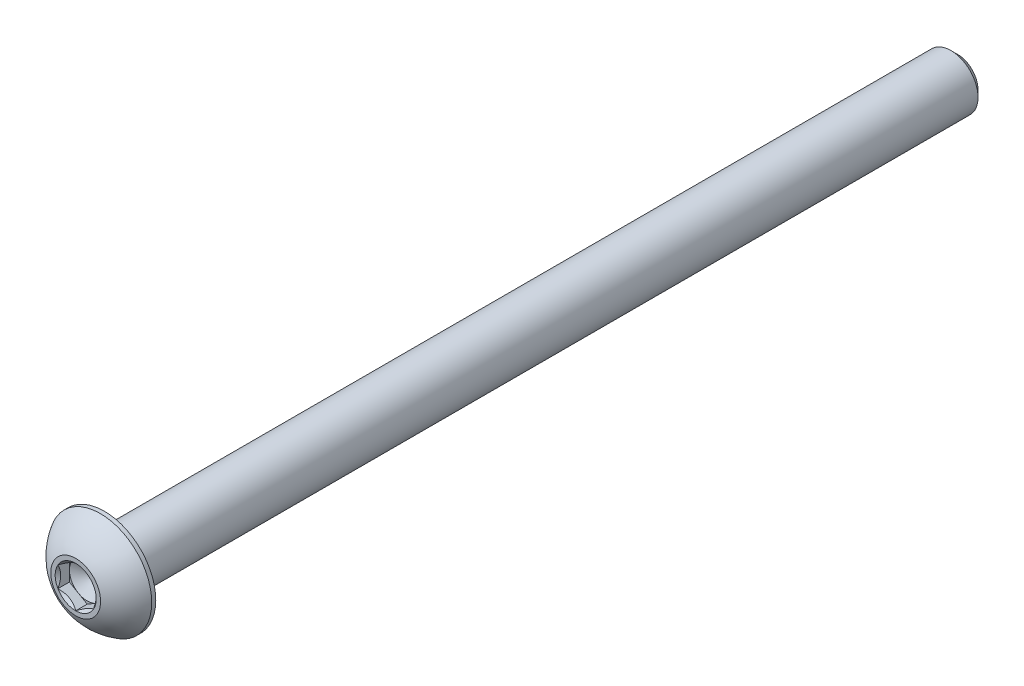
ISO-10303-21;
HEADER;
FILE_DESCRIPTION(('STEP AP214'),'2;1');
FILE_NAME('part.step','',(''),(''),'','','');
FILE_SCHEMA(('AUTOMOTIVE_DESIGN { 1 0 10303 214 1 1 1 1 }'));
ENDSEC;
DATA;
#1=APPLICATION_CONTEXT('core data for automotive mechanical design processes');
#2=APPLICATION_PROTOCOL_DEFINITION('international standard','automotive_design',2000,#1);
#3=PRODUCT_CONTEXT('',#1,'mechanical');
#4=PRODUCT('Part','Part','',(#3));
#5=PRODUCT_RELATED_PRODUCT_CATEGORY('part','',(#4));
#6=PRODUCT_DEFINITION_FORMATION('','',#4);
#7=PRODUCT_DEFINITION_CONTEXT('part definition',#1,'design');
#8=PRODUCT_DEFINITION('design','',#6,#7);
#9=PRODUCT_DEFINITION_SHAPE('','',#8);
#10=(LENGTH_UNIT() NAMED_UNIT(*) SI_UNIT(.MILLI.,.METRE.));
#11=(NAMED_UNIT(*) PLANE_ANGLE_UNIT() SI_UNIT($,.RADIAN.));
#12=(NAMED_UNIT(*) SI_UNIT($,.STERADIAN.) SOLID_ANGLE_UNIT());
#13=UNCERTAINTY_MEASURE_WITH_UNIT(LENGTH_MEASURE(1.E-05),#10,'distance_accuracy_value','');
#14=(GEOMETRIC_REPRESENTATION_CONTEXT(3) GLOBAL_UNCERTAINTY_ASSIGNED_CONTEXT((#13)) GLOBAL_UNIT_ASSIGNED_CONTEXT((#10,
#11,#12)) REPRESENTATION_CONTEXT('',''));
#15=CARTESIAN_POINT('',(0.,0.,0.));
#16=DIRECTION('',(0.,0.,1.));
#17=DIRECTION('',(1.,0.,0.));
#18=AXIS2_PLACEMENT_3D('',#15,#16,#17);
#19=CARTESIAN_POINT('',(0.,1.5875,39.3827));
#20=DIRECTION('',(0.,0.,-1.));
#21=DIRECTION('',(-1.,0.,0.));
#22=AXIS2_PLACEMENT_3D('',#19,#20,#21);
#23=PLANE('',#22);
#24=CARTESIAN_POINT('',(0.,0.,39.3827));
#25=DIRECTION('',(0.,0.,1.));
#26=DIRECTION('',(1.,0.,0.));
#27=AXIS2_PLACEMENT_3D('',#24,#25,#26);
#28=CIRCLE('',#27,2.2225);
#29=CARTESIAN_POINT('',(2.2225,0.,39.3827));
#30=VERTEX_POINT('',#29);
#31=EDGE_CURVE('E187',#30,#30,#28,.T.);
#32=ORIENTED_EDGE('',*,*,#31,.T.);
#33=EDGE_LOOP('',(#32));
#34=FACE_BOUND('',#33,.T.);
#35=CARTESIAN_POINT('',(0.,0.,39.3827));
#36=DIRECTION('',(0.,0.,1.));
#37=DIRECTION('',(1.,0.,0.));
#38=AXIS2_PLACEMENT_3D('',#35,#36,#37);
#39=CIRCLE('',#38,1.83308710467706);
#40=CARTESIAN_POINT('',(0.,1.83308710467706,39.3827));
#41=VERTEX_POINT('',#40);
#42=CARTESIAN_POINT('',(-1.5875,0.91654355233853,39.3827));
#43=VERTEX_POINT('',#42);
#44=EDGE_CURVE('E129',#41,#43,#39,.T.);
#45=ORIENTED_EDGE('',*,*,#44,.F.);
#46=CARTESIAN_POINT('',(0.,0.,39.3827));
#47=DIRECTION('',(0.,0.,1.));
#48=DIRECTION('',(1.,0.,0.));
#49=AXIS2_PLACEMENT_3D('',#46,#47,#48);
#50=CIRCLE('',#49,1.83308710467706);
#51=CARTESIAN_POINT('',(1.5875,0.916543552338531,39.3827));
#52=VERTEX_POINT('',#51);
#53=EDGE_CURVE('E113',#52,#41,#50,.T.);
#54=ORIENTED_EDGE('',*,*,#53,.F.);
#55=CARTESIAN_POINT('',(0.,0.,39.3827));
#56=DIRECTION('',(0.,0.,1.));
#57=DIRECTION('',(1.,0.,0.));
#58=AXIS2_PLACEMENT_3D('',#55,#56,#57);
#59=CIRCLE('',#58,1.83308710467706);
#60=CARTESIAN_POINT('',(1.5875,-0.916543552338529,39.3827));
#61=VERTEX_POINT('',#60);
#62=EDGE_CURVE('E125',#61,#52,#59,.T.);
#63=ORIENTED_EDGE('',*,*,#62,.F.);
#64=CARTESIAN_POINT('',(0.,0.,39.3827));
#65=DIRECTION('',(0.,0.,1.));
#66=DIRECTION('',(1.,0.,0.));
#67=AXIS2_PLACEMENT_3D('',#64,#65,#66);
#68=CIRCLE('',#67,1.83308710467706);
#69=CARTESIAN_POINT('',(0.,-1.83308710467706,39.3827));
#70=VERTEX_POINT('',#69);
#71=EDGE_CURVE('E149',#70,#61,#68,.T.);
#72=ORIENTED_EDGE('',*,*,#71,.F.);
#73=CARTESIAN_POINT('',(0.,0.,39.3827));
#74=DIRECTION('',(0.,0.,1.));
#75=DIRECTION('',(1.,0.,0.));
#76=AXIS2_PLACEMENT_3D('',#73,#74,#75);
#77=CIRCLE('',#76,1.83308710467706);
#78=CARTESIAN_POINT('',(-1.5875,-0.916543552338533,39.3827));
#79=VERTEX_POINT('',#78);
#80=EDGE_CURVE('E463',#79,#70,#77,.T.);
#81=ORIENTED_EDGE('',*,*,#80,.F.);
#82=CARTESIAN_POINT('',(0.,0.,39.3827));
#83=DIRECTION('',(0.,0.,1.));
#84=DIRECTION('',(1.,0.,0.));
#85=AXIS2_PLACEMENT_3D('',#82,#83,#84);
#86=CIRCLE('',#85,1.83308710467706);
#87=EDGE_CURVE('E474',#43,#79,#86,.T.);
#88=ORIENTED_EDGE('',*,*,#87,.F.);
#89=EDGE_LOOP('',(#45,#54,#63,#72,#81,#88));
#90=FACE_BOUND('',#89,.T.);
#91=ADVANCED_FACE('F39',(#34,#90),#23,.F.);
#92=CARTESIAN_POINT('',(0.,0.,-39.3827));
#93=DIRECTION('',(0.,0.,1.));
#94=DIRECTION('',(1.,0.,0.));
#95=AXIS2_PLACEMENT_3D('',#92,#93,#94);
#96=CONICAL_SURFACE('',#95,1.8176875,0.785398163397447);
#97=CARTESIAN_POINT('',(0.,0.,-38.7873875));
#98=DIRECTION('',(0.,0.,1.));
#99=DIRECTION('',(1.,0.,0.));
#100=AXIS2_PLACEMENT_3D('',#97,#98,#99);
#101=CIRCLE('',#100,2.413);
#102=CARTESIAN_POINT('',(2.413,0.,-38.7873875));
#103=VERTEX_POINT('',#102);
#104=EDGE_CURVE('E11',#103,#103,#101,.T.);
#105=ORIENTED_EDGE('',*,*,#104,.F.);
#106=EDGE_LOOP('',(#105));
#107=FACE_BOUND('',#106,.T.);
#108=CARTESIAN_POINT('',(0.,0.,-39.3827));
#109=DIRECTION('',(0.,0.,1.));
#110=DIRECTION('',(1.,0.,0.));
#111=AXIS2_PLACEMENT_3D('',#108,#109,#110);
#112=CIRCLE('',#111,1.8176875);
#113=CARTESIAN_POINT('',(1.8176875,0.,-39.3827));
#114=VERTEX_POINT('',#113);
#115=EDGE_CURVE('E178',#114,#114,#112,.T.);
#116=ORIENTED_EDGE('',*,*,#115,.T.);
#117=EDGE_LOOP('',(#116));
#118=FACE_BOUND('',#117,.T.);
#119=ADVANCED_FACE('F41',(#107,#118),#96,.T.);
#120=CARTESIAN_POINT('',(0.,0.,39.3827));
#121=DIRECTION('',(0.,0.,1.));
#122=DIRECTION('',(1.,0.,0.));
#123=AXIS2_PLACEMENT_3D('',#120,#121,#122);
#124=CYLINDRICAL_SURFACE('',#123,2.413);
#125=CARTESIAN_POINT('',(0.,0.,36.8173));
#126=DIRECTION('',(0.,0.,1.));
#127=DIRECTION('',(1.,0.,0.));
#128=AXIS2_PLACEMENT_3D('',#125,#126,#127);
#129=CIRCLE('',#128,2.413);
#130=CARTESIAN_POINT('',(2.413,0.,36.8173));
#131=VERTEX_POINT('',#130);
#132=EDGE_CURVE('E48',#131,#131,#129,.T.);
#133=ORIENTED_EDGE('',*,*,#132,.F.);
#134=EDGE_LOOP('',(#133));
#135=FACE_BOUND('',#134,.T.);
#136=ORIENTED_EDGE('',*,*,#104,.T.);
#137=EDGE_LOOP('',(#136));
#138=FACE_BOUND('',#137,.T.);
#139=ADVANCED_FACE('F205',(#135,#138),#124,.T.);
#140=CARTESIAN_POINT('',(0.,4.5847,36.8173));
#141=DIRECTION('',(0.,0.,1.));
#142=DIRECTION('',(1.,0.,0.));
#143=AXIS2_PLACEMENT_3D('',#140,#141,#142);
#144=PLANE('',#143);
#145=CARTESIAN_POINT('',(0.,0.,36.8173));
#146=DIRECTION('',(0.,0.,1.));
#147=DIRECTION('',(1.,0.,0.));
#148=AXIS2_PLACEMENT_3D('',#145,#146,#147);
#149=CIRCLE('',#148,4.5847);
#150=CARTESIAN_POINT('',(4.5847,0.,36.8173));
#151=VERTEX_POINT('',#150);
#152=EDGE_CURVE('E196',#151,#151,#149,.T.);
#153=ORIENTED_EDGE('',*,*,#152,.F.);
#154=EDGE_LOOP('',(#153));
#155=FACE_BOUND('',#154,.T.);
#156=ORIENTED_EDGE('',*,*,#132,.T.);
#157=EDGE_LOOP('',(#156));
#158=FACE_BOUND('',#157,.T.);
#159=ADVANCED_FACE('F203',(#155,#158),#144,.F.);
#160=CARTESIAN_POINT('',(0.,0.,39.3827));
#161=DIRECTION('',(0.,0.,1.));
#162=DIRECTION('',(1.,0.,0.));
#163=AXIS2_PLACEMENT_3D('',#160,#161,#162);
#164=CYLINDRICAL_SURFACE('',#163,4.5847);
#165=CARTESIAN_POINT('',(0.,0.,37.1801571428571));
#166=DIRECTION('',(0.,0.,1.));
#167=DIRECTION('',(1.,0.,0.));
#168=AXIS2_PLACEMENT_3D('',#165,#166,#167);
#169=CIRCLE('',#168,4.5847);
#170=CARTESIAN_POINT('',(4.5847,0.,37.1801571428571));
#171=VERTEX_POINT('',#170);
#172=EDGE_CURVE('E192',#171,#171,#169,.T.);
#173=ORIENTED_EDGE('',*,*,#172,.F.);
#174=EDGE_LOOP('',(#173));
#175=FACE_BOUND('',#174,.T.);
#176=ORIENTED_EDGE('',*,*,#152,.T.);
#177=EDGE_LOOP('',(#176));
#178=FACE_BOUND('',#177,.T.);
#179=ADVANCED_FACE('F224',(#175,#178),#164,.T.);
#180=CARTESIAN_POINT('',(0.,0.,34.6311096257943));
#181=DIRECTION('',(0.,0.,1.));
#182=DIRECTION('',(0.,1.,0.));
#183=AXIS2_PLACEMENT_3D('',#180,#181,#182);
#184=SPHERICAL_SURFACE('',#183,5.24567606074224);
#185=ORIENTED_EDGE('',*,*,#31,.F.);
#186=EDGE_LOOP('',(#185));
#187=FACE_BOUND('',#186,.T.);
#188=ORIENTED_EDGE('',*,*,#172,.T.);
#189=EDGE_LOOP('',(#188));
#190=FACE_BOUND('',#189,.T.);
#191=ADVANCED_FACE('F216',(#187,#190),#184,.T.);
#192=CARTESIAN_POINT('',(0.,1.8176875,-39.3827));
#193=DIRECTION('',(0.,0.,1.));
#194=DIRECTION('',(1.,0.,0.));
#195=AXIS2_PLACEMENT_3D('',#192,#193,#194);
#196=PLANE('',#195);
#197=ORIENTED_EDGE('',*,*,#115,.F.);
#198=EDGE_LOOP('',(#197));
#199=FACE_BOUND('',#198,.T.);
#200=ADVANCED_FACE('F214',(#199),#196,.F.);
#201=CARTESIAN_POINT('',(1.5875,0.916543552338531,39.3827));
#202=DIRECTION('',(-0.499999999999999,-0.866025403784439,0.));
#203=DIRECTION('',(0.866025403784439,-0.5,0.));
#204=AXIS2_PLACEMENT_3D('',#201,#202,#203);
#205=PLANE('',#204);
#206=CARTESIAN_POINT('',(1.5877,0.916428082284693,39.3828154809637));
#207=CARTESIAN_POINT('',(1.53312479190086,0.947937093371809,39.3513308083706));
#208=CARTESIAN_POINT('',(1.47763696320971,0.979973006203394,39.3216950460135));
#209=CARTESIAN_POINT('',(1.36449087915364,1.04529792829092,39.2674322600208));
#210=CARTESIAN_POINT('',(1.30682185887062,1.07859315267522,39.2428354351332));
#211=CARTESIAN_POINT('',(1.1905349781269,1.14573141457583,39.2007003642726));
#212=CARTESIAN_POINT('',(1.13194674474407,1.17955734689075,39.1830561927298));
#213=CARTESIAN_POINT('',(1.01348022674557,1.24795402294714,39.155871470085));
#214=CARTESIAN_POINT('',(0.953605562983895,1.28252267618758,39.1463106206951));
#215=CARTESIAN_POINT('',(0.850418771876558,1.34209759781022,39.137684413104));
#216=CARTESIAN_POINT('',(0.807240015952288,1.36702686416637,39.1364071928096));
#217=CARTESIAN_POINT('',(0.720953038535399,1.41684467380557,39.1385570558147));
#218=CARTESIAN_POINT('',(0.677844847078612,1.44173319974742,39.1419857885493));
#219=CARTESIAN_POINT('',(0.592046335002031,1.49126899379091,39.1533509944333));
#220=CARTESIAN_POINT('',(0.549356408925406,1.51591603410293,39.1612913718016));
#221=CARTESIAN_POINT('',(0.464693063478359,1.56479643938728,39.1812484144511));
#222=CARTESIAN_POINT('',(0.422719959755075,1.58902962212064,39.1932668292087));
#223=CARTESIAN_POINT('',(0.315211458113566,1.65109968448354,39.2289468972473));
#224=CARTESIAN_POINT('',(0.250342771708898,1.68855163804125,39.2552985723031));
#225=CARTESIAN_POINT('',(0.154961599380921,1.74361998356043,39.2997835368517));
#226=CARTESIAN_POINT('',(0.123530699536153,1.76176662204668,39.3154128578011));
#227=CARTESIAN_POINT('',(0.0612469855696333,1.79772614107138,39.3480984878611));
#228=CARTESIAN_POINT('',(0.0303939039605731,1.8155391760437,39.365154115657));
#229=CARTESIAN_POINT('',(-0.000200000000002724,1.8332025747309,39.3828154809637));
#230=B_SPLINE_CURVE_WITH_KNOTS('',3,(#206,#207,#208,#209,#210,#211,#212,#213,#214,#215,#216,
#217,#218,#219,#220,#221,#222,#223,#224,#225,#226,#227,#228,#229),.UNSPECIFIED.,.F.,.F.,(4,2,2,
2,2,2,2,2,2,2,2,4),(0.,0.211482650810816,0.424197870807277,0.633533884524818,0.842342653263349,
0.991755553727142,1.14122083674205,1.29081565918877,1.44047473906438,1.6781878086972,
1.79671410024894,1.91518409436631),.UNSPECIFIED.);
#231=EDGE_CURVE('E110',#52,#41,#230,.T.);
#232=ORIENTED_EDGE('',*,*,#231,.T.);
#233=DIRECTION('',(0.,0.,-1.));
#234=VECTOR('',#233,1.);
#235=CARTESIAN_POINT('',(0.,1.83308710467706,39.3827));
#236=LINE('',#235,#234);
#237=CARTESIAN_POINT('',(0.,1.83308710467706,38.35654));
#238=VERTEX_POINT('',#237);
#239=EDGE_CURVE('E175',#41,#238,#236,.T.);
#240=ORIENTED_EDGE('',*,*,#239,.T.);
#241=DIRECTION('',(-0.866025403784439,0.499999999999999,0.));
#242=VECTOR('',#241,1.);
#243=CARTESIAN_POINT('',(1.5875,0.916543552338531,38.35654));
#244=LINE('',#243,#242);
#245=CARTESIAN_POINT('',(0.793749999999999,1.3748153285078,38.35654));
#246=VERTEX_POINT('',#245);
#247=EDGE_CURVE('E505',#246,#238,#244,.T.);
#248=ORIENTED_EDGE('',*,*,#247,.F.);
#249=CARTESIAN_POINT('',(1.5875,0.916543552338531,38.35654));
#250=VERTEX_POINT('',#249);
#251=EDGE_CURVE('E55',#250,#246,#244,.T.);
#252=ORIENTED_EDGE('',*,*,#251,.F.);
#253=DIRECTION('',(0.,0.,-1.));
#254=VECTOR('',#253,1.);
#255=CARTESIAN_POINT('',(1.5875,0.916543552338531,39.3827));
#256=LINE('',#255,#254);
#257=EDGE_CURVE('E144',#52,#250,#256,.T.);
#258=ORIENTED_EDGE('',*,*,#257,.F.);
#259=EDGE_LOOP('',(#232,#240,#248,#252,#258));
#260=FACE_BOUND('',#259,.T.);
#261=ADVANCED_FACE('F151',(#260),#205,.T.);
#262=CARTESIAN_POINT('',(0.,1.83308710467706,39.3827));
#263=DIRECTION('',(0.5,-0.866025403784438,0.));
#264=DIRECTION('',(0.866025403784439,0.5,0.));
#265=AXIS2_PLACEMENT_3D('',#262,#263,#264);
#266=PLANE('',#265);
#267=CARTESIAN_POINT('',(0.000199999999999068,1.8332025747309,39.3828154809637));
#268=CARTESIAN_POINT('',(-0.0543752080991364,1.80169356364378,39.3513308083706));
#269=CARTESIAN_POINT('',(-0.10986303679029,1.7696576508122,39.3216950460135));
#270=CARTESIAN_POINT('',(-0.223009120846359,1.70433272872468,39.2674322600208));
#271=CARTESIAN_POINT('',(-0.280678141129382,1.67103750434037,39.2428354351332));
#272=CARTESIAN_POINT('',(-0.396965021873104,1.60389924243976,39.2007003642726));
#273=CARTESIAN_POINT('',(-0.455553255255932,1.57007331012484,39.1830561927298));
#274=CARTESIAN_POINT('',(-0.574019773254431,1.50167663406845,39.155871470085));
#275=CARTESIAN_POINT('',(-0.633894437016105,1.46710798082801,39.1463106206951));
#276=CARTESIAN_POINT('',(-0.737081228123442,1.40753305920537,39.137684413104));
#277=CARTESIAN_POINT('',(-0.780259984047712,1.38260379284922,39.1364071928096));
#278=CARTESIAN_POINT('',(-0.866546961464601,1.33278598321002,39.1385570558147));
#279=CARTESIAN_POINT('',(-0.909655152921388,1.30789745726817,39.1419857885493));
#280=CARTESIAN_POINT('',(-0.995453664997969,1.25836166322468,39.1533509944333));
#281=CARTESIAN_POINT('',(-1.03814359107459,1.23371462291266,39.1612913718016));
#282=CARTESIAN_POINT('',(-1.12280693652164,1.18483421762831,39.1812484144511));
#283=CARTESIAN_POINT('',(-1.16478004024492,1.16060103489495,39.1932668292087));
#284=CARTESIAN_POINT('',(-1.27228854188643,1.09853097253205,39.2289468972473));
#285=CARTESIAN_POINT('',(-1.3371572282911,1.06107901897434,39.2552985723031));
#286=CARTESIAN_POINT('',(-1.43253840061908,1.00601067345516,39.2997835368517));
#287=CARTESIAN_POINT('',(-1.46396930046384,0.987864034968913,39.3154128578011));
#288=CARTESIAN_POINT('',(-1.52625301443036,0.951904515944213,39.3480984878611));
#289=CARTESIAN_POINT('',(-1.55710609603942,0.934091480971892,39.365154115657));
#290=CARTESIAN_POINT('',(-1.5877,0.916428082284692,39.3828154809637));
#291=B_SPLINE_CURVE_WITH_KNOTS('',3,(#267,#268,#269,#270,#271,#272,#273,#274,#275,#276,#277,
#278,#279,#280,#281,#282,#283,#284,#285,#286,#287,#288,#289,#290),.UNSPECIFIED.,.F.,.F.,(4,2,2,
2,2,2,2,2,2,2,2,4),(0.,0.211482650810816,0.424197870807276,0.633533884524817,0.842342653263348,
0.991755553727141,1.14122083674204,1.29081565918877,1.44047473906438,1.6781878086972,
1.79671410024894,1.91518409436631),.UNSPECIFIED.);
#292=EDGE_CURVE('E490',#41,#43,#291,.T.);
#293=ORIENTED_EDGE('',*,*,#292,.T.);
#294=DIRECTION('',(0.,0.,-1.));
#295=VECTOR('',#294,1.);
#296=CARTESIAN_POINT('',(-1.5875,0.91654355233853,39.3827));
#297=LINE('',#296,#295);
#298=CARTESIAN_POINT('',(-1.5875,0.91654355233853,38.35654));
#299=VERTEX_POINT('',#298);
#300=EDGE_CURVE('E171',#43,#299,#297,.T.);
#301=ORIENTED_EDGE('',*,*,#300,.T.);
#302=DIRECTION('',(-0.866025403784438,-0.5,0.));
#303=VECTOR('',#302,1.);
#304=CARTESIAN_POINT('',(0.,1.83308710467706,38.35654));
#305=LINE('',#304,#303);
#306=CARTESIAN_POINT('',(-0.793750000000001,1.3748153285078,38.35654));
#307=VERTEX_POINT('',#306);
#308=EDGE_CURVE('E508',#307,#299,#305,.T.);
#309=ORIENTED_EDGE('',*,*,#308,.F.);
#310=EDGE_CURVE('E509',#238,#307,#305,.T.);
#311=ORIENTED_EDGE('',*,*,#310,.F.);
#312=ORIENTED_EDGE('',*,*,#239,.F.);
#313=EDGE_LOOP('',(#293,#301,#309,#311,#312));
#314=FACE_BOUND('',#313,.T.);
#315=ADVANCED_FACE('F222',(#314),#266,.T.);
#316=CARTESIAN_POINT('',(-1.5875,0.91654355233853,39.3827));
#317=DIRECTION('',(1.,0.,0.));
#318=DIRECTION('',(0.,1.,0.));
#319=AXIS2_PLACEMENT_3D('',#316,#317,#318);
#320=PLANE('',#319);
#321=CARTESIAN_POINT('',(-1.5875,-1.8064504268921,39.954486986584));
#322=CARTESIAN_POINT('',(-1.5875,-1.76236619947005,39.9213776518922));
#323=CARTESIAN_POINT('',(-1.5875,-1.7180340172246,39.8885993672874));
#324=CARTESIAN_POINT('',(-1.5875,-1.62877387436181,39.8238409272978));
#325=CARTESIAN_POINT('',(-1.5875,-1.58384576476286,39.7918609774832));
#326=CARTESIAN_POINT('',(-1.5875,-1.44736053267712,39.6968669615479));
#327=CARTESIAN_POINT('',(-1.5875,-1.3547728804759,39.6353088242448));
#328=CARTESIAN_POINT('',(-1.5875,-1.16075761948671,39.5146575197201));
#329=CARTESIAN_POINT('',(-1.5875,-1.05912459725148,39.4558908440981));
#330=CARTESIAN_POINT('',(-1.5875,-0.850810108093359,39.3485306781203));
#331=CARTESIAN_POINT('',(-1.5875,-0.744147188151387,39.2999029254242));
#332=CARTESIAN_POINT('',(-1.5875,-0.583837187923048,39.2404180795062));
#333=CARTESIAN_POINT('',(-1.5875,-0.532518160842362,39.2233101147626));
#334=CARTESIAN_POINT('',(-1.5875,-0.42865998551387,39.1932170530757));
#335=CARTESIAN_POINT('',(-1.5875,-0.376120751676573,39.1802322462879));
#336=CARTESIAN_POINT('',(-1.5875,-0.271003698108571,39.1592703974627));
#337=CARTESIAN_POINT('',(-1.5875,-0.218442994151925,39.1512088512206));
#338=CARTESIAN_POINT('',(-1.5875,-0.112783135871374,39.1402474681039));
#339=CARTESIAN_POINT('',(-1.5875,-0.0596840710482713,39.1373467869566));
#340=CARTESIAN_POINT('',(-1.5875,0.0447055832560292,39.1369138193186));
#341=CARTESIAN_POINT('',(-1.5875,0.0959954901561852,39.1392001279368));
#342=CARTESIAN_POINT('',(-1.5875,0.19812518570528,39.1486197058015));
#343=CARTESIAN_POINT('',(-1.5875,0.248964929488492,39.1557534527826));
#344=CARTESIAN_POINT('',(-1.5875,0.350686556652123,39.1746031096994));
#345=CARTESIAN_POINT('',(-1.5875,0.401553911407878,39.186396261495));
#346=CARTESIAN_POINT('',(-1.5875,0.50217981053946,39.2139444375564));
#347=CARTESIAN_POINT('',(-1.5875,0.551938454553038,39.2296991042323));
#348=CARTESIAN_POINT('',(-1.5875,0.70959794154669,39.2855173760564));
#349=CARTESIAN_POINT('',(-1.5875,0.815228306930164,39.3319791563384));
#350=CARTESIAN_POINT('',(-1.5875,1.02151735170486,39.4352514550853));
#351=CARTESIAN_POINT('',(-1.5875,1.12215634479546,39.4920993580816));
#352=CARTESIAN_POINT('',(-1.5875,1.31447644029508,39.6093491247074));
#353=CARTESIAN_POINT('',(-1.5875,1.40635401847359,39.6694326845134));
#354=CARTESIAN_POINT('',(-1.5875,1.54171769329396,39.7623019080447));
#355=CARTESIAN_POINT('',(-1.5875,1.58625419266992,39.7935831278697));
#356=CARTESIAN_POINT('',(-1.5875,1.67471932537719,39.8569692036077));
#357=CARTESIAN_POINT('',(-1.5875,1.71864812234279,39.8890738308869));
#358=CARTESIAN_POINT('',(-1.5875,1.76232404534813,39.9215197844761));
#359=B_SPLINE_CURVE_WITH_KNOTS('',3,(#321,#322,#323,#324,#325,#326,#327,#328,#329,#330,#331,
#332,#333,#334,#335,#336,#337,#338,#339,#340,#341,#342,#343,#344,#345,#346,#347,#348,#349,#350,
#351,#352,#353,#354,#355,#356,#357,#358),.UNSPECIFIED.,.F.,.F.,(4,2,2,2,2,2,2,2,2,2,2,2,2,2,2,2,
2,2,4),(0.,0.165394720611774,0.330831599805607,0.664230904656284,1.01613642769877,
1.36683276443451,1.5289815746679,1.69114179313303,1.85043410106595,2.00970034776347,
2.16348276168557,2.31728033368488,2.47374234648083,2.63019024115108,2.97536284656899,
3.32180328575216,3.6509785319665,3.81424551593161,3.97746764647571),.UNSPECIFIED.);
#360=EDGE_CURVE('E482',#43,#79,#359,.F.);
#361=ORIENTED_EDGE('',*,*,#360,.T.);
#362=DIRECTION('',(0.,0.,-1.));
#363=VECTOR('',#362,1.);
#364=CARTESIAN_POINT('',(-1.5875,-0.916543552338532,39.3827));
#365=LINE('',#364,#363);
#366=CARTESIAN_POINT('',(-1.5875,-0.916543552338532,38.35654));
#367=VERTEX_POINT('',#366);
#368=EDGE_CURVE('E167',#79,#367,#365,.T.);
#369=ORIENTED_EDGE('',*,*,#368,.T.);
#370=DIRECTION('',(0.,-1.,0.));
#371=VECTOR('',#370,1.);
#372=CARTESIAN_POINT('',(-1.5875,0.91654355233853,38.35654));
#373=LINE('',#372,#371);
#374=CARTESIAN_POINT('',(-1.5875,0.,38.35654));
#375=VERTEX_POINT('',#374);
#376=EDGE_CURVE('E513',#375,#367,#373,.T.);
#377=ORIENTED_EDGE('',*,*,#376,.F.);
#378=EDGE_CURVE('E514',#299,#375,#373,.T.);
#379=ORIENTED_EDGE('',*,*,#378,.F.);
#380=ORIENTED_EDGE('',*,*,#300,.F.);
#381=EDGE_LOOP('',(#361,#369,#377,#379,#380));
#382=FACE_BOUND('',#381,.T.);
#383=ADVANCED_FACE('F343',(#382),#320,.T.);
#384=CARTESIAN_POINT('',(-1.5875,-0.916543552338532,39.3827));
#385=DIRECTION('',(0.499999999999999,0.866025403784439,0.));
#386=DIRECTION('',(-0.866025403784439,0.5,0.));
#387=AXIS2_PLACEMENT_3D('',#384,#385,#386);
#388=PLANE('',#387);
#389=CARTESIAN_POINT('',(-1.5877,-0.916428082284694,39.3828154809637));
#390=CARTESIAN_POINT('',(-1.53312479190086,-0.94793709337181,39.3513308083706));
#391=CARTESIAN_POINT('',(-1.47763696320971,-0.979973006203395,39.3216950460135));
#392=CARTESIAN_POINT('',(-1.36449087915364,-1.04529792829092,39.2674322600208));
#393=CARTESIAN_POINT('',(-1.30682185887062,-1.07859315267522,39.2428354351332));
#394=CARTESIAN_POINT('',(-1.1905349781269,-1.14573141457583,39.2007003642726));
#395=CARTESIAN_POINT('',(-1.13194674474407,-1.17955734689075,39.1830561927298));
#396=CARTESIAN_POINT('',(-1.01348022674557,-1.24795402294715,39.155871470085));
#397=CARTESIAN_POINT('',(-0.953605562983895,-1.28252267618759,39.1463106206951));
#398=CARTESIAN_POINT('',(-0.850418771876557,-1.34209759781022,39.137684413104));
#399=CARTESIAN_POINT('',(-0.807240015952287,-1.36702686416637,39.1364071928096));
#400=CARTESIAN_POINT('',(-0.720953038535398,-1.41684467380557,39.1385570558147));
#401=CARTESIAN_POINT('',(-0.677844847078612,-1.44173319974742,39.1419857885493));
#402=CARTESIAN_POINT('',(-0.59204633500203,-1.49126899379091,39.1533509944333));
#403=CARTESIAN_POINT('',(-0.549356408925405,-1.51591603410293,39.1612913718016));
#404=CARTESIAN_POINT('',(-0.464693063478358,-1.56479643938728,39.1812484144511));
#405=CARTESIAN_POINT('',(-0.422719959755074,-1.58902962212064,39.1932668292087));
#406=CARTESIAN_POINT('',(-0.315211458113565,-1.65109968448354,39.2289468972473));
#407=CARTESIAN_POINT('',(-0.250342771708898,-1.68855163804125,39.2552985723031));
#408=CARTESIAN_POINT('',(-0.154961599380922,-1.74361998356043,39.2997835368517));
#409=CARTESIAN_POINT('',(-0.123530699536154,-1.76176662204668,39.3154128578011));
#410=CARTESIAN_POINT('',(-0.0612469855696344,-1.79772614107138,39.3480984878611));
#411=CARTESIAN_POINT('',(-0.0303939039605742,-1.8155391760437,39.365154115657));
#412=CARTESIAN_POINT('',(0.000200000000001885,-1.8332025747309,39.3828154809637));
#413=B_SPLINE_CURVE_WITH_KNOTS('',3,(#389,#390,#391,#392,#393,#394,#395,#396,#397,#398,#399,
#400,#401,#402,#403,#404,#405,#406,#407,#408,#409,#410,#411,#412),.UNSPECIFIED.,.F.,.F.,(4,2,2,
2,2,2,2,2,2,2,2,4),(0.,0.211482650810817,0.424197870807277,0.633533884524818,0.842342653263349,
0.991755553727142,1.14122083674205,1.29081565918877,1.44047473906438,1.6781878086972,
1.79671410024894,1.91518409436631),.UNSPECIFIED.);
#414=EDGE_CURVE('E466',#79,#70,#413,.T.);
#415=ORIENTED_EDGE('',*,*,#414,.T.);
#416=DIRECTION('',(0.,0.,-1.));
#417=VECTOR('',#416,1.);
#418=CARTESIAN_POINT('',(0.,-1.83308710467706,39.3827));
#419=LINE('',#418,#417);
#420=CARTESIAN_POINT('',(0.,-1.83308710467706,38.35654));
#421=VERTEX_POINT('',#420);
#422=EDGE_CURVE('E157',#70,#421,#419,.T.);
#423=ORIENTED_EDGE('',*,*,#422,.T.);
#424=DIRECTION('',(0.866025403784439,-0.499999999999999,0.));
#425=VECTOR('',#424,1.);
#426=CARTESIAN_POINT('',(-1.5875,-0.916543552338532,38.35654));
#427=LINE('',#426,#425);
#428=CARTESIAN_POINT('',(-0.793749999999999,-1.3748153285078,38.35654));
#429=VERTEX_POINT('',#428);
#430=EDGE_CURVE('E518',#429,#421,#427,.T.);
#431=ORIENTED_EDGE('',*,*,#430,.F.);
#432=EDGE_CURVE('E519',#367,#429,#427,.T.);
#433=ORIENTED_EDGE('',*,*,#432,.F.);
#434=ORIENTED_EDGE('',*,*,#368,.F.);
#435=EDGE_LOOP('',(#415,#423,#431,#433,#434));
#436=FACE_BOUND('',#435,.T.);
#437=ADVANCED_FACE('F353',(#436),#388,.T.);
#438=CARTESIAN_POINT('',(0.,-1.83308710467706,39.3827));
#439=DIRECTION('',(-0.5,0.866025403784438,0.));
#440=DIRECTION('',(-0.866025403784439,-0.5,0.));
#441=AXIS2_PLACEMENT_3D('',#438,#439,#440);
#442=PLANE('',#441);
#443=CARTESIAN_POINT('',(-0.00019999999999924,-1.8332025747309,39.3828154809637));
#444=CARTESIAN_POINT('',(0.0543752080991368,-1.80169356364378,39.3513308083706));
#445=CARTESIAN_POINT('',(0.10986303679029,-1.7696576508122,39.3216950460135));
#446=CARTESIAN_POINT('',(0.223009120846359,-1.70433272872468,39.2674322600208));
#447=CARTESIAN_POINT('',(0.280678141129382,-1.67103750434037,39.2428354351332));
#448=CARTESIAN_POINT('',(0.396965021873104,-1.60389924243976,39.2007003642726));
#449=CARTESIAN_POINT('',(0.455553255255933,-1.57007331012484,39.1830561927298));
#450=CARTESIAN_POINT('',(0.574019773254432,-1.50167663406845,39.155871470085));
#451=CARTESIAN_POINT('',(0.633894437016105,-1.46710798082801,39.1463106206951));
#452=CARTESIAN_POINT('',(0.737081228123442,-1.40753305920537,39.137684413104));
#453=CARTESIAN_POINT('',(0.780259984047712,-1.38260379284922,39.1364071928096));
#454=CARTESIAN_POINT('',(0.866546961464601,-1.33278598321002,39.1385570558147));
#455=CARTESIAN_POINT('',(0.909655152921387,-1.30789745726817,39.1419857885493));
#456=CARTESIAN_POINT('',(0.995453664997969,-1.25836166322469,39.1533509944333));
#457=CARTESIAN_POINT('',(1.03814359107459,-1.23371462291266,39.1612913718016));
#458=CARTESIAN_POINT('',(1.12280693652164,-1.18483421762831,39.1812484144511));
#459=CARTESIAN_POINT('',(1.16478004024492,-1.16060103489495,39.1932668292087));
#460=CARTESIAN_POINT('',(1.27228854188643,-1.09853097253205,39.2289468972473));
#461=CARTESIAN_POINT('',(1.3371572282911,-1.06107901897434,39.2552985723031));
#462=CARTESIAN_POINT('',(1.43253840061908,-1.00601067345516,39.2997835368517));
#463=CARTESIAN_POINT('',(1.46396930046384,-0.987864034968913,39.3154128578011));
#464=CARTESIAN_POINT('',(1.52625301443036,-0.951904515944213,39.3480984878611));
#465=CARTESIAN_POINT('',(1.55710609603942,-0.934091480971892,39.365154115657));
#466=CARTESIAN_POINT('',(1.5877,-0.916428082284692,39.3828154809637));
#467=B_SPLINE_CURVE_WITH_KNOTS('',3,(#443,#444,#445,#446,#447,#448,#449,#450,#451,#452,#453,
#454,#455,#456,#457,#458,#459,#460,#461,#462,#463,#464,#465,#466),.UNSPECIFIED.,.F.,.F.,(4,2,2,
2,2,2,2,2,2,2,2,4),(0.,0.211482650810816,0.424197870807277,0.633533884524816,0.842342653263347,
0.99175555372714,1.14122083674204,1.29081565918877,1.44047473906437,1.6781878086972,
1.79671410024894,1.91518409436631),.UNSPECIFIED.);
#468=EDGE_CURVE('E455',#70,#61,#467,.T.);
#469=ORIENTED_EDGE('',*,*,#468,.T.);
#470=DIRECTION('',(0.,0.,-1.));
#471=VECTOR('',#470,1.);
#472=CARTESIAN_POINT('',(1.5875,-0.916543552338531,39.3827));
#473=LINE('',#472,#471);
#474=CARTESIAN_POINT('',(1.5875,-0.916543552338531,38.35654));
#475=VERTEX_POINT('',#474);
#476=EDGE_CURVE('E147',#61,#475,#473,.T.);
#477=ORIENTED_EDGE('',*,*,#476,.T.);
#478=DIRECTION('',(0.866025403784438,0.5,0.));
#479=VECTOR('',#478,1.);
#480=CARTESIAN_POINT('',(0.,-1.83308710467706,38.35654));
#481=LINE('',#480,#479);
#482=CARTESIAN_POINT('',(0.79375,-1.3748153285078,38.35654));
#483=VERTEX_POINT('',#482);
#484=EDGE_CURVE('E522',#483,#475,#481,.T.);
#485=ORIENTED_EDGE('',*,*,#484,.F.);
#486=EDGE_CURVE('E523',#421,#483,#481,.T.);
#487=ORIENTED_EDGE('',*,*,#486,.F.);
#488=ORIENTED_EDGE('',*,*,#422,.F.);
#489=EDGE_LOOP('',(#469,#477,#485,#487,#488));
#490=FACE_BOUND('',#489,.T.);
#491=ADVANCED_FACE('F363',(#490),#442,.T.);
#492=CARTESIAN_POINT('',(1.5875,-0.916543552338531,39.3827));
#493=DIRECTION('',(-1.,0.,0.));
#494=DIRECTION('',(0.,-1.,0.));
#495=AXIS2_PLACEMENT_3D('',#492,#493,#494);
#496=PLANE('',#495);
#497=CARTESIAN_POINT('',(1.5875,-1.8064504268921,39.954486986584));
#498=CARTESIAN_POINT('',(1.5875,-1.76236619947005,39.9213776518922));
#499=CARTESIAN_POINT('',(1.5875,-1.71803401722459,39.8885993672874));
#500=CARTESIAN_POINT('',(1.5875,-1.62877387436181,39.8238409272978));
#501=CARTESIAN_POINT('',(1.5875,-1.58384576476286,39.7918609774832));
#502=CARTESIAN_POINT('',(1.5875,-1.44736053267712,39.6968669615479));
#503=CARTESIAN_POINT('',(1.5875,-1.3547728804759,39.6353088242448));
#504=CARTESIAN_POINT('',(1.5875,-1.16075761948671,39.5146575197201));
#505=CARTESIAN_POINT('',(1.5875,-1.05912459725148,39.4558908440981));
#506=CARTESIAN_POINT('',(1.5875,-0.850810108093356,39.3485306781203));
#507=CARTESIAN_POINT('',(1.5875,-0.744147188151385,39.2999029254242));
#508=CARTESIAN_POINT('',(1.5875,-0.583837187923047,39.2404180795062));
#509=CARTESIAN_POINT('',(1.5875,-0.53251816084236,39.2233101147626));
#510=CARTESIAN_POINT('',(1.5875,-0.428659985513868,39.1932170530757));
#511=CARTESIAN_POINT('',(1.5875,-0.376120751676572,39.1802322462879));
#512=CARTESIAN_POINT('',(1.5875,-0.27100369810857,39.1592703974627));
#513=CARTESIAN_POINT('',(1.5875,-0.218442994151923,39.1512088512206));
#514=CARTESIAN_POINT('',(1.5875,-0.112783135871373,39.1402474681039));
#515=CARTESIAN_POINT('',(1.5875,-0.0596840710482703,39.1373467869566));
#516=CARTESIAN_POINT('',(1.5875,0.0447055832560299,39.1369138193186));
#517=CARTESIAN_POINT('',(1.5875,0.0959954901561857,39.1392001279368));
#518=CARTESIAN_POINT('',(1.5875,0.19812518570528,39.1486197058015));
#519=CARTESIAN_POINT('',(1.5875,0.248964929488492,39.1557534527826));
#520=CARTESIAN_POINT('',(1.5875,0.350686556652123,39.1746031096994));
#521=CARTESIAN_POINT('',(1.5875,0.401553911407877,39.186396261495));
#522=CARTESIAN_POINT('',(1.5875,0.50217981053946,39.2139444375564));
#523=CARTESIAN_POINT('',(1.5875,0.551938454553039,39.2296991042323));
#524=CARTESIAN_POINT('',(1.5875,0.709597941546691,39.2855173760564));
#525=CARTESIAN_POINT('',(1.5875,0.815228306930165,39.3319791563384));
#526=CARTESIAN_POINT('',(1.5875,1.02151735170486,39.4352514550853));
#527=CARTESIAN_POINT('',(1.5875,1.12215634479546,39.4920993580816));
#528=CARTESIAN_POINT('',(1.5875,1.31447644029508,39.6093491247074));
#529=CARTESIAN_POINT('',(1.5875,1.40635401847359,39.6694326845134));
#530=CARTESIAN_POINT('',(1.5875,1.54171769329396,39.7623019080447));
#531=CARTESIAN_POINT('',(1.5875,1.58625419266992,39.7935831278697));
#532=CARTESIAN_POINT('',(1.5875,1.67471932537719,39.8569692036077));
#533=CARTESIAN_POINT('',(1.5875,1.71864812234279,39.8890738308869));
#534=CARTESIAN_POINT('',(1.5875,1.76232404534813,39.9215197844761));
#535=B_SPLINE_CURVE_WITH_KNOTS('',3,(#497,#498,#499,#500,#501,#502,#503,#504,#505,#506,#507,
#508,#509,#510,#511,#512,#513,#514,#515,#516,#517,#518,#519,#520,#521,#522,#523,#524,#525,#526,
#527,#528,#529,#530,#531,#532,#533,#534),.UNSPECIFIED.,.F.,.F.,(4,2,2,2,2,2,2,2,2,2,2,2,2,2,2,2,
2,2,4),(0.,0.165394720611774,0.330831599805608,0.664230904656285,1.01613642769877,
1.36683276443451,1.5289815746679,1.69114179313303,1.85043410106595,2.00970034776347,
2.16348276168557,2.31728033368488,2.47374234648083,2.63019024115108,2.97536284656899,
3.32180328575216,3.6509785319665,3.81424551593161,3.97746764647571),.UNSPECIFIED.);
#536=EDGE_CURVE('E136',#61,#52,#535,.T.);
#537=ORIENTED_EDGE('',*,*,#536,.T.);
#538=ORIENTED_EDGE('',*,*,#257,.T.);
#539=DIRECTION('',(0.,1.,0.));
#540=VECTOR('',#539,1.);
#541=CARTESIAN_POINT('',(1.5875,-0.916543552338531,38.35654));
#542=LINE('',#541,#540);
#543=CARTESIAN_POINT('',(1.5875,0.,38.35654));
#544=VERTEX_POINT('',#543);
#545=EDGE_CURVE('E160',#544,#250,#542,.T.);
#546=ORIENTED_EDGE('',*,*,#545,.F.);
#547=EDGE_CURVE('E153',#475,#544,#542,.T.);
#548=ORIENTED_EDGE('',*,*,#547,.F.);
#549=ORIENTED_EDGE('',*,*,#476,.F.);
#550=EDGE_LOOP('',(#537,#538,#546,#548,#549));
#551=FACE_BOUND('',#550,.T.);
#552=ADVANCED_FACE('F142',(#551),#496,.T.);
#553=CARTESIAN_POINT('',(0.,0.,38.35654));
#554=DIRECTION('',(0.,0.,1.));
#555=DIRECTION('',(1.,0.,0.));
#556=AXIS2_PLACEMENT_3D('',#553,#554,#555);
#557=PLANE('',#556);
#558=CARTESIAN_POINT('',(0.,0.,38.35654));
#559=DIRECTION('',(0.,0.,1.));
#560=DIRECTION('',(1.,0.,0.));
#561=AXIS2_PLACEMENT_3D('',#558,#559,#560);
#562=CIRCLE('',#561,1.5875);
#563=EDGE_CURVE('E182',#483,#544,#562,.T.);
#564=ORIENTED_EDGE('',*,*,#563,.F.);
#565=ORIENTED_EDGE('',*,*,#484,.T.);
#566=ORIENTED_EDGE('',*,*,#547,.T.);
#567=EDGE_LOOP('',(#564,#565,#566));
#568=FACE_BOUND('',#567,.T.);
#569=ADVANCED_FACE('F265',(#568),#557,.T.);
#570=EDGE_CURVE('E538',#429,#483,#562,.T.);
#571=ORIENTED_EDGE('',*,*,#570,.F.);
#572=ORIENTED_EDGE('',*,*,#430,.T.);
#573=ORIENTED_EDGE('',*,*,#486,.T.);
#574=EDGE_LOOP('',(#571,#572,#573));
#575=FACE_BOUND('',#574,.T.);
#576=ADVANCED_FACE('F270',(#575),#557,.T.);
#577=EDGE_CURVE('E541',#375,#429,#562,.T.);
#578=ORIENTED_EDGE('',*,*,#577,.F.);
#579=ORIENTED_EDGE('',*,*,#376,.T.);
#580=ORIENTED_EDGE('',*,*,#432,.T.);
#581=EDGE_LOOP('',(#578,#579,#580));
#582=FACE_BOUND('',#581,.T.);
#583=ADVANCED_FACE('F283',(#582),#557,.T.);
#584=EDGE_CURVE('E543',#307,#375,#562,.T.);
#585=ORIENTED_EDGE('',*,*,#584,.F.);
#586=ORIENTED_EDGE('',*,*,#308,.T.);
#587=ORIENTED_EDGE('',*,*,#378,.T.);
#588=EDGE_LOOP('',(#585,#586,#587));
#589=FACE_BOUND('',#588,.T.);
#590=ADVANCED_FACE('F292',(#589),#557,.T.);
#591=EDGE_CURVE('E188',#246,#307,#562,.T.);
#592=ORIENTED_EDGE('',*,*,#591,.F.);
#593=ORIENTED_EDGE('',*,*,#247,.T.);
#594=ORIENTED_EDGE('',*,*,#310,.T.);
#595=EDGE_LOOP('',(#592,#593,#594));
#596=FACE_BOUND('',#595,.T.);
#597=ADVANCED_FACE('F301',(#596),#557,.T.);
#598=EDGE_CURVE('E183',#544,#246,#562,.T.);
#599=ORIENTED_EDGE('',*,*,#598,.F.);
#600=ORIENTED_EDGE('',*,*,#545,.T.);
#601=ORIENTED_EDGE('',*,*,#251,.T.);
#602=EDGE_LOOP('',(#599,#600,#601));
#603=FACE_BOUND('',#602,.T.);
#604=ADVANCED_FACE('F273',(#603),#557,.T.);
#605=CARTESIAN_POINT('',(0.,0.,38.35654));
#606=DIRECTION('',(0.,0.,1.));
#607=DIRECTION('',(1.,0.,0.));
#608=AXIS2_PLACEMENT_3D('',#605,#606,#607);
#609=CONICAL_SURFACE('',#608,1.5875,1.0471975511966);
#610=CARTESIAN_POINT('',(0.,0.,37.4399964476615));
#611=VERTEX_POINT('',#610);
#612=VERTEX_LOOP('',#611);
#613=FACE_BOUND('',#612,.T.);
#614=ORIENTED_EDGE('',*,*,#598,.T.);
#615=ORIENTED_EDGE('',*,*,#591,.T.);
#616=ORIENTED_EDGE('',*,*,#584,.T.);
#617=ORIENTED_EDGE('',*,*,#577,.T.);
#618=ORIENTED_EDGE('',*,*,#570,.T.);
#619=ORIENTED_EDGE('',*,*,#563,.T.);
#620=EDGE_LOOP('',(#614,#615,#616,#617,#618,#619));
#621=FACE_BOUND('',#620,.T.);
#622=ADVANCED_FACE('F233',(#613,#621),#609,.F.);
#623=CARTESIAN_POINT('',(0.,0.,39.3827));
#624=DIRECTION('',(0.,0.,1.));
#625=DIRECTION('',(1.,0.,0.));
#626=AXIS2_PLACEMENT_3D('',#623,#624,#625);
#627=CONICAL_SURFACE('',#626,1.83308710467706,0.78539816339745);
#628=ORIENTED_EDGE('',*,*,#44,.T.);
#629=ORIENTED_EDGE('',*,*,#292,.F.);
#630=EDGE_LOOP('',(#628,#629));
#631=FACE_BOUND('',#630,.T.);
#632=ADVANCED_FACE('F324',(#631),#627,.F.);
#633=CARTESIAN_POINT('',(0.,0.,39.3827));
#634=DIRECTION('',(0.,0.,1.));
#635=DIRECTION('',(1.,0.,0.));
#636=AXIS2_PLACEMENT_3D('',#633,#634,#635);
#637=CONICAL_SURFACE('',#636,1.83308710467706,0.78539816339745);
#638=ORIENTED_EDGE('',*,*,#87,.T.);
#639=ORIENTED_EDGE('',*,*,#360,.F.);
#640=EDGE_LOOP('',(#638,#639));
#641=FACE_BOUND('',#640,.T.);
#642=ADVANCED_FACE('F386',(#641),#637,.F.);
#643=CARTESIAN_POINT('',(0.,0.,39.3827));
#644=DIRECTION('',(0.,0.,1.));
#645=DIRECTION('',(1.,0.,0.));
#646=AXIS2_PLACEMENT_3D('',#643,#644,#645);
#647=CONICAL_SURFACE('',#646,1.83308710467706,0.78539816339745);
#648=ORIENTED_EDGE('',*,*,#80,.T.);
#649=ORIENTED_EDGE('',*,*,#414,.F.);
#650=EDGE_LOOP('',(#648,#649));
#651=FACE_BOUND('',#650,.T.);
#652=ADVANCED_FACE('F396',(#651),#647,.F.);
#653=CARTESIAN_POINT('',(0.,0.,39.3827));
#654=DIRECTION('',(0.,0.,1.));
#655=DIRECTION('',(1.,0.,0.));
#656=AXIS2_PLACEMENT_3D('',#653,#654,#655);
#657=CONICAL_SURFACE('',#656,1.83308710467706,0.78539816339745);
#658=ORIENTED_EDGE('',*,*,#71,.T.);
#659=ORIENTED_EDGE('',*,*,#468,.F.);
#660=EDGE_LOOP('',(#658,#659));
#661=FACE_BOUND('',#660,.T.);
#662=ADVANCED_FACE('F406',(#661),#657,.F.);
#663=CARTESIAN_POINT('',(0.,0.,39.3827));
#664=DIRECTION('',(0.,0.,1.));
#665=DIRECTION('',(1.,0.,0.));
#666=AXIS2_PLACEMENT_3D('',#663,#664,#665);
#667=CONICAL_SURFACE('',#666,1.83308710467706,0.78539816339745);
#668=ORIENTED_EDGE('',*,*,#62,.T.);
#669=ORIENTED_EDGE('',*,*,#536,.F.);
#670=EDGE_LOOP('',(#668,#669));
#671=FACE_BOUND('',#670,.T.);
#672=ADVANCED_FACE('F135',(#671),#667,.F.);
#673=CARTESIAN_POINT('',(0.,0.,39.3827));
#674=DIRECTION('',(0.,0.,1.));
#675=DIRECTION('',(1.,0.,0.));
#676=AXIS2_PLACEMENT_3D('',#673,#674,#675);
#677=CONICAL_SURFACE('',#676,1.83308710467706,0.78539816339745);
#678=ORIENTED_EDGE('',*,*,#53,.T.);
#679=ORIENTED_EDGE('',*,*,#231,.F.);
#680=EDGE_LOOP('',(#678,#679));
#681=FACE_BOUND('',#680,.T.);
#682=ADVANCED_FACE('F112',(#681),#677,.F.);
#683=CLOSED_SHELL('',(#91,#119,#139,#159,#179,#191,#200,#261,#315,#383,#437,#491,#552,#569,#576,
#583,#590,#597,#604,#622,#632,#642,#652,#662,#672,#682));
#684=MANIFOLD_SOLID_BREP('B2',#683);
#685=ADVANCED_BREP_SHAPE_REPRESENTATION('',(#18,#684),#14);
#686=SHAPE_DEFINITION_REPRESENTATION(#9,#685);
ENDSEC;
END-ISO-10303-21;
